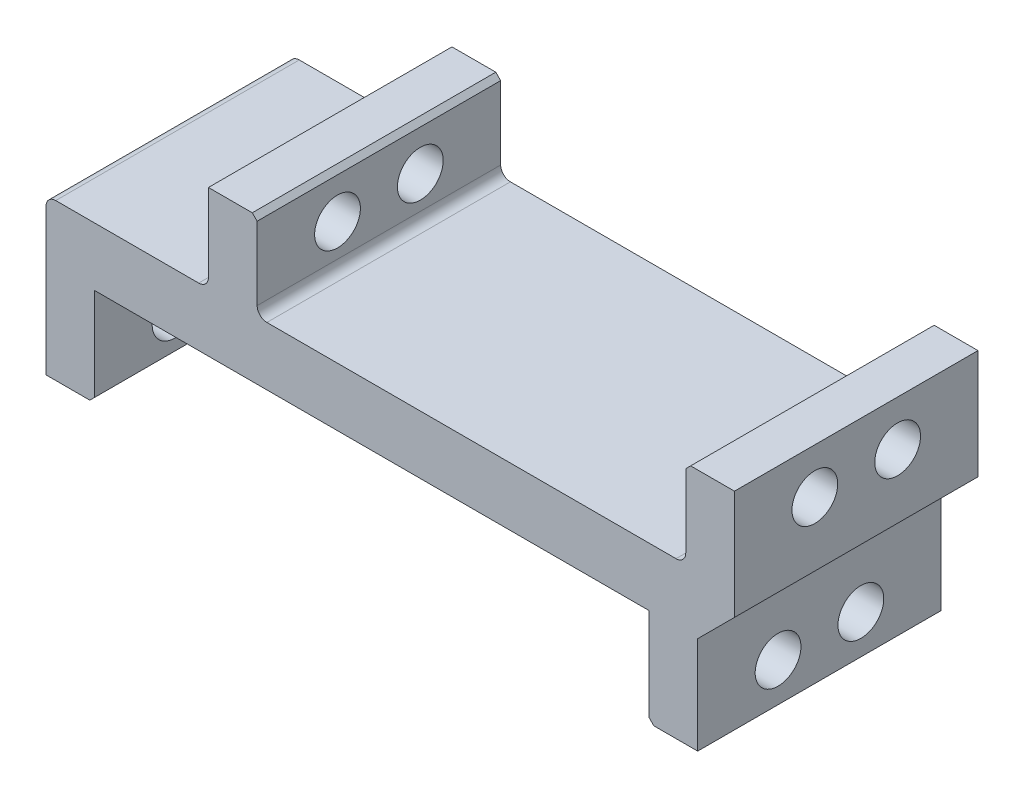
ISO-10303-21;
HEADER;
FILE_DESCRIPTION(('STEP AP214'),'2;1');
FILE_NAME('part.step','',(''),(''),'','','');
FILE_SCHEMA(('AUTOMOTIVE_DESIGN { 1 0 10303 214 1 1 1 1 }'));
ENDSEC;
DATA;
#1=APPLICATION_CONTEXT('core data for automotive mechanical design processes');
#2=APPLICATION_PROTOCOL_DEFINITION('international standard','automotive_design',2000,#1);
#3=PRODUCT_CONTEXT('',#1,'mechanical');
#4=PRODUCT('Part','Part','',(#3));
#5=PRODUCT_RELATED_PRODUCT_CATEGORY('part','',(#4));
#6=PRODUCT_DEFINITION_FORMATION('','',#4);
#7=PRODUCT_DEFINITION_CONTEXT('part definition',#1,'design');
#8=PRODUCT_DEFINITION('design','',#6,#7);
#9=PRODUCT_DEFINITION_SHAPE('','',#8);
#10=(LENGTH_UNIT() NAMED_UNIT(*) SI_UNIT(.MILLI.,.METRE.));
#11=(NAMED_UNIT(*) PLANE_ANGLE_UNIT() SI_UNIT($,.RADIAN.));
#12=(NAMED_UNIT(*) SI_UNIT($,.STERADIAN.) SOLID_ANGLE_UNIT());
#13=UNCERTAINTY_MEASURE_WITH_UNIT(LENGTH_MEASURE(1.E-05),#10,'distance_accuracy_value','');
#14=(GEOMETRIC_REPRESENTATION_CONTEXT(3) GLOBAL_UNCERTAINTY_ASSIGNED_CONTEXT((#13)) GLOBAL_UNIT_ASSIGNED_CONTEXT((#10,
#11,#12)) REPRESENTATION_CONTEXT('',''));
#15=CARTESIAN_POINT('',(0.,0.,0.));
#16=DIRECTION('',(0.,0.,1.));
#17=DIRECTION('',(1.,0.,0.));
#18=AXIS2_PLACEMENT_3D('',#15,#16,#17);
#19=CARTESIAN_POINT('',(-28.45,-9.29999999999999,12.5));
#20=DIRECTION('',(0.,1.,0.));
#21=DIRECTION('',(0.,0.,1.));
#22=AXIS2_PLACEMENT_3D('',#19,#20,#21);
#23=PLANE('',#22);
#24=DIRECTION('',(1.,0.,0.));
#25=VECTOR('',#24,1.);
#26=CARTESIAN_POINT('',(-28.45,-9.29999999999999,-12.5));
#27=LINE('',#26,#25);
#28=CARTESIAN_POINT('',(-33.45,-9.29999999999999,-12.5));
#29=VERTEX_POINT('',#28);
#30=CARTESIAN_POINT('',(-28.95,-9.29999999999999,-12.5));
#31=VERTEX_POINT('',#30);
#32=EDGE_CURVE('E267',#29,#31,#27,.T.);
#33=ORIENTED_EDGE('',*,*,#32,.T.);
#34=DIRECTION('',(0.,0.,1.));
#35=VECTOR('',#34,1.);
#36=CARTESIAN_POINT('',(-28.95,-9.29999999999999,12.5));
#37=LINE('',#36,#35);
#38=CARTESIAN_POINT('',(-28.95,-9.29999999999999,12.5));
#39=VERTEX_POINT('',#38);
#40=EDGE_CURVE('E11',#31,#39,#37,.T.);
#41=ORIENTED_EDGE('',*,*,#40,.T.);
#42=DIRECTION('',(1.,0.,0.));
#43=VECTOR('',#42,1.);
#44=CARTESIAN_POINT('',(-28.45,-9.29999999999999,12.5));
#45=LINE('',#44,#43);
#46=CARTESIAN_POINT('',(-33.45,-9.29999999999999,12.5));
#47=VERTEX_POINT('',#46);
#48=EDGE_CURVE('E214',#47,#39,#45,.T.);
#49=ORIENTED_EDGE('',*,*,#48,.F.);
#50=DIRECTION('',(0.,0.,-1.));
#51=VECTOR('',#50,1.);
#52=CARTESIAN_POINT('',(-33.45,-9.29999999999999,12.5));
#53=LINE('',#52,#51);
#54=EDGE_CURVE('E266',#47,#29,#53,.T.);
#55=ORIENTED_EDGE('',*,*,#54,.T.);
#56=EDGE_LOOP('',(#33,#41,#49,#55));
#57=FACE_BOUND('',#56,.T.);
#58=ADVANCED_FACE('F39',(#57),#23,.F.);
#59=CARTESIAN_POINT('',(-28.45,-9.29999999999999,12.5));
#60=DIRECTION('',(-1.,0.,0.));
#61=DIRECTION('',(0.,-1.,0.));
#62=AXIS2_PLACEMENT_3D('',#59,#60,#61);
#63=PLANE('',#62);
#64=CARTESIAN_POINT('',(-28.45,-5.29999999999998,4.25));
#65=DIRECTION('',(-1.,0.,0.));
#66=DIRECTION('',(0.,-1.,0.));
#67=AXIS2_PLACEMENT_3D('',#64,#65,#66);
#68=CIRCLE('',#67,2.35);
#69=CARTESIAN_POINT('',(-28.45,-7.64999999999998,4.25));
#70=VERTEX_POINT('',#69);
#71=EDGE_CURVE('E356',#70,#70,#68,.T.);
#72=ORIENTED_EDGE('',*,*,#71,.T.);
#73=EDGE_LOOP('',(#72));
#74=FACE_BOUND('',#73,.T.);
#75=CARTESIAN_POINT('',(-28.45,-5.29999999999998,-4.25));
#76=DIRECTION('',(-1.,0.,0.));
#77=DIRECTION('',(0.,-1.,0.));
#78=AXIS2_PLACEMENT_3D('',#75,#76,#77);
#79=CIRCLE('',#78,2.35);
#80=CARTESIAN_POINT('',(-28.45,-7.64999999999998,-4.25));
#81=VERTEX_POINT('',#80);
#82=EDGE_CURVE('E864',#81,#81,#79,.T.);
#83=ORIENTED_EDGE('',*,*,#82,.T.);
#84=EDGE_LOOP('',(#83));
#85=FACE_BOUND('',#84,.T.);
#86=DIRECTION('',(0.,1.,0.));
#87=VECTOR('',#86,1.);
#88=CARTESIAN_POINT('',(-28.45,-9.29999999999999,12.5));
#89=LINE('',#88,#87);
#90=CARTESIAN_POINT('',(-28.45,-8.79999999999997,12.5));
#91=VERTEX_POINT('',#90);
#92=CARTESIAN_POINT('',(-28.45,0.700000000000014,12.5));
#93=VERTEX_POINT('',#92);
#94=EDGE_CURVE('E200',#91,#93,#89,.T.);
#95=ORIENTED_EDGE('',*,*,#94,.F.);
#96=DIRECTION('',(0.,0.,-1.));
#97=VECTOR('',#96,1.);
#98=CARTESIAN_POINT('',(-28.45,-8.79999999999997,12.5));
#99=LINE('',#98,#97);
#100=CARTESIAN_POINT('',(-28.45,-8.79999999999997,-12.5));
#101=VERTEX_POINT('',#100);
#102=EDGE_CURVE('E48',#91,#101,#99,.T.);
#103=ORIENTED_EDGE('',*,*,#102,.T.);
#104=DIRECTION('',(0.,1.,0.));
#105=VECTOR('',#104,1.);
#106=CARTESIAN_POINT('',(-28.45,-9.29999999999999,-12.5));
#107=LINE('',#106,#105);
#108=CARTESIAN_POINT('',(-28.45,0.700000000000014,-12.5));
#109=VERTEX_POINT('',#108);
#110=EDGE_CURVE('E220',#101,#109,#107,.T.);
#111=ORIENTED_EDGE('',*,*,#110,.T.);
#112=DIRECTION('',(0.,0.,-1.));
#113=VECTOR('',#112,1.);
#114=CARTESIAN_POINT('',(-28.45,0.700000000000014,12.5));
#115=LINE('',#114,#113);
#116=EDGE_CURVE('E217',#93,#109,#115,.T.);
#117=ORIENTED_EDGE('',*,*,#116,.F.);
#118=EDGE_LOOP('',(#95,#103,#111,#117));
#119=FACE_BOUND('',#118,.T.);
#120=ADVANCED_FACE('F218',(#74,#85,#119),#63,.F.);
#121=CARTESIAN_POINT('',(-28.45,0.700000000000014,12.5));
#122=DIRECTION('',(0.,1.,0.));
#123=DIRECTION('',(0.,0.,1.));
#124=AXIS2_PLACEMENT_3D('',#121,#122,#123);
#125=PLANE('',#124);
#126=DIRECTION('',(1.,0.,0.));
#127=VECTOR('',#126,1.);
#128=CARTESIAN_POINT('',(-28.45,0.700000000000014,-12.5));
#129=LINE('',#128,#127);
#130=CARTESIAN_POINT('',(28.45,0.700000000000014,-12.5));
#131=VERTEX_POINT('',#130);
#132=EDGE_CURVE('E272',#109,#131,#129,.T.);
#133=ORIENTED_EDGE('',*,*,#132,.T.);
#134=DIRECTION('',(0.,0.,-1.));
#135=VECTOR('',#134,1.);
#136=CARTESIAN_POINT('',(28.45,0.700000000000014,12.5));
#137=LINE('',#136,#135);
#138=CARTESIAN_POINT('',(28.45,0.700000000000014,12.5));
#139=VERTEX_POINT('',#138);
#140=EDGE_CURVE('E224',#139,#131,#137,.T.);
#141=ORIENTED_EDGE('',*,*,#140,.F.);
#142=DIRECTION('',(1.,0.,0.));
#143=VECTOR('',#142,1.);
#144=CARTESIAN_POINT('',(-28.45,0.700000000000014,12.5));
#145=LINE('',#144,#143);
#146=EDGE_CURVE('E206',#93,#139,#145,.T.);
#147=ORIENTED_EDGE('',*,*,#146,.F.);
#148=ORIENTED_EDGE('',*,*,#116,.T.);
#149=EDGE_LOOP('',(#133,#141,#147,#148));
#150=FACE_BOUND('',#149,.T.);
#151=ADVANCED_FACE('F226',(#150),#125,.F.);
#152=CARTESIAN_POINT('',(28.45,0.700000000000014,12.5));
#153=DIRECTION('',(1.,0.,0.));
#154=DIRECTION('',(0.,1.,0.));
#155=AXIS2_PLACEMENT_3D('',#152,#153,#154);
#156=PLANE('',#155);
#157=CARTESIAN_POINT('',(28.45,-5.29999999999998,4.25));
#158=DIRECTION('',(1.,0.,0.));
#159=DIRECTION('',(0.,1.,0.));
#160=AXIS2_PLACEMENT_3D('',#157,#158,#159);
#161=CIRCLE('',#160,2.35);
#162=CARTESIAN_POINT('',(28.45,-2.94999999999998,4.25));
#163=VERTEX_POINT('',#162);
#164=EDGE_CURVE('E874',#163,#163,#161,.T.);
#165=ORIENTED_EDGE('',*,*,#164,.T.);
#166=EDGE_LOOP('',(#165));
#167=FACE_BOUND('',#166,.T.);
#168=CARTESIAN_POINT('',(28.45,-5.29999999999998,-4.25));
#169=DIRECTION('',(1.,0.,0.));
#170=DIRECTION('',(0.,1.,0.));
#171=AXIS2_PLACEMENT_3D('',#168,#169,#170);
#172=CIRCLE('',#171,2.35);
#173=CARTESIAN_POINT('',(28.45,-2.94999999999997,-4.25));
#174=VERTEX_POINT('',#173);
#175=EDGE_CURVE('E860',#174,#174,#172,.T.);
#176=ORIENTED_EDGE('',*,*,#175,.T.);
#177=EDGE_LOOP('',(#176));
#178=FACE_BOUND('',#177,.T.);
#179=DIRECTION('',(0.,-1.,0.));
#180=VECTOR('',#179,1.);
#181=CARTESIAN_POINT('',(28.45,0.700000000000014,-12.5));
#182=LINE('',#181,#180);
#183=CARTESIAN_POINT('',(28.45,-8.79999999999998,-12.5));
#184=VERTEX_POINT('',#183);
#185=EDGE_CURVE('E274',#131,#184,#182,.T.);
#186=ORIENTED_EDGE('',*,*,#185,.T.);
#187=DIRECTION('',(0.,0.,1.));
#188=VECTOR('',#187,1.);
#189=CARTESIAN_POINT('',(28.45,-8.79999999999998,12.5));
#190=LINE('',#189,#188);
#191=CARTESIAN_POINT('',(28.45,-8.79999999999998,12.5));
#192=VERTEX_POINT('',#191);
#193=EDGE_CURVE('E387',#184,#192,#190,.T.);
#194=ORIENTED_EDGE('',*,*,#193,.T.);
#195=DIRECTION('',(0.,-1.,0.));
#196=VECTOR('',#195,1.);
#197=CARTESIAN_POINT('',(28.45,0.700000000000014,12.5));
#198=LINE('',#197,#196);
#199=EDGE_CURVE('E229',#139,#192,#198,.T.);
#200=ORIENTED_EDGE('',*,*,#199,.F.);
#201=ORIENTED_EDGE('',*,*,#140,.T.);
#202=EDGE_LOOP('',(#186,#194,#200,#201));
#203=FACE_BOUND('',#202,.T.);
#204=ADVANCED_FACE('F395',(#167,#178,#203),#156,.F.);
#205=CARTESIAN_POINT('',(28.45,-9.29999999999998,12.5));
#206=DIRECTION('',(0.,1.,0.));
#207=DIRECTION('',(-1.,0.,0.));
#208=AXIS2_PLACEMENT_3D('',#205,#206,#207);
#209=PLANE('',#208);
#210=DIRECTION('',(1.,0.,0.));
#211=VECTOR('',#210,1.);
#212=CARTESIAN_POINT('',(28.45,-9.29999999999998,12.5));
#213=LINE('',#212,#211);
#214=CARTESIAN_POINT('',(28.95,-9.29999999999998,12.5));
#215=VERTEX_POINT('',#214);
#216=CARTESIAN_POINT('',(33.45,-9.29999999999998,12.5));
#217=VERTEX_POINT('',#216);
#218=EDGE_CURVE('E231',#215,#217,#213,.T.);
#219=ORIENTED_EDGE('',*,*,#218,.F.);
#220=DIRECTION('',(0.,0.,-1.));
#221=VECTOR('',#220,1.);
#222=CARTESIAN_POINT('',(28.95,-9.29999999999998,12.5));
#223=LINE('',#222,#221);
#224=CARTESIAN_POINT('',(28.95,-9.29999999999998,-12.5));
#225=VERTEX_POINT('',#224);
#226=EDGE_CURVE('E384',#215,#225,#223,.T.);
#227=ORIENTED_EDGE('',*,*,#226,.T.);
#228=DIRECTION('',(1.,0.,0.));
#229=VECTOR('',#228,1.);
#230=CARTESIAN_POINT('',(28.45,-9.29999999999998,-12.5));
#231=LINE('',#230,#229);
#232=CARTESIAN_POINT('',(33.45,-9.29999999999998,-12.5));
#233=VERTEX_POINT('',#232);
#234=EDGE_CURVE('E277',#225,#233,#231,.T.);
#235=ORIENTED_EDGE('',*,*,#234,.T.);
#236=DIRECTION('',(0.,0.,-1.));
#237=VECTOR('',#236,1.);
#238=CARTESIAN_POINT('',(33.45,-9.29999999999998,12.5));
#239=LINE('',#238,#237);
#240=EDGE_CURVE('E348',#217,#233,#239,.T.);
#241=ORIENTED_EDGE('',*,*,#240,.F.);
#242=EDGE_LOOP('',(#219,#227,#235,#241));
#243=FACE_BOUND('',#242,.T.);
#244=ADVANCED_FACE('F404',(#243),#209,.F.);
#245=CARTESIAN_POINT('',(33.45,-9.29999999999998,12.5));
#246=DIRECTION('',(-1.,0.,0.));
#247=DIRECTION('',(0.,-1.,0.));
#248=AXIS2_PLACEMENT_3D('',#245,#246,#247);
#249=PLANE('',#248);
#250=CARTESIAN_POINT('',(33.45,-5.29999999999998,4.25));
#251=DIRECTION('',(-1.,0.,0.));
#252=DIRECTION('',(0.,-1.,0.));
#253=AXIS2_PLACEMENT_3D('',#250,#251,#252);
#254=CIRCLE('',#253,2.35);
#255=CARTESIAN_POINT('',(33.45,-7.64999999999998,4.25));
#256=VERTEX_POINT('',#255);
#257=EDGE_CURVE('E856',#256,#256,#254,.T.);
#258=ORIENTED_EDGE('',*,*,#257,.T.);
#259=EDGE_LOOP('',(#258));
#260=FACE_BOUND('',#259,.T.);
#261=CARTESIAN_POINT('',(33.45,-5.29999999999998,-4.25));
#262=DIRECTION('',(-1.,0.,0.));
#263=DIRECTION('',(0.,-1.,0.));
#264=AXIS2_PLACEMENT_3D('',#261,#262,#263);
#265=CIRCLE('',#264,2.35);
#266=CARTESIAN_POINT('',(33.45,-7.64999999999998,-4.25));
#267=VERTEX_POINT('',#266);
#268=EDGE_CURVE('E859',#267,#267,#265,.T.);
#269=ORIENTED_EDGE('',*,*,#268,.T.);
#270=EDGE_LOOP('',(#269));
#271=FACE_BOUND('',#270,.T.);
#272=DIRECTION('',(0.,1.,0.));
#273=VECTOR('',#272,1.);
#274=CARTESIAN_POINT('',(33.45,-9.29999999999998,-12.5));
#275=LINE('',#274,#273);
#276=CARTESIAN_POINT('',(33.45,0.700000000000022,-12.5));
#277=VERTEX_POINT('',#276);
#278=EDGE_CURVE('E279',#233,#277,#275,.T.);
#279=ORIENTED_EDGE('',*,*,#278,.T.);
#280=DIRECTION('',(0.,0.,-1.));
#281=VECTOR('',#280,1.);
#282=CARTESIAN_POINT('',(33.45,0.700000000000022,12.5));
#283=LINE('',#282,#281);
#284=CARTESIAN_POINT('',(33.45,0.700000000000022,12.5));
#285=VERTEX_POINT('',#284);
#286=EDGE_CURVE('E345',#285,#277,#283,.T.);
#287=ORIENTED_EDGE('',*,*,#286,.F.);
#288=DIRECTION('',(0.,1.,0.));
#289=VECTOR('',#288,1.);
#290=CARTESIAN_POINT('',(33.45,-9.29999999999998,12.5));
#291=LINE('',#290,#289);
#292=EDGE_CURVE('E236',#217,#285,#291,.T.);
#293=ORIENTED_EDGE('',*,*,#292,.F.);
#294=ORIENTED_EDGE('',*,*,#240,.T.);
#295=EDGE_LOOP('',(#279,#287,#293,#294));
#296=FACE_BOUND('',#295,.T.);
#297=ADVANCED_FACE('F411',(#260,#271,#296),#249,.F.);
#298=CARTESIAN_POINT('',(33.45,0.700000000000022,12.5));
#299=DIRECTION('',(-0.707106781186546,0.707106781186549,0.));
#300=DIRECTION('',(-0.707106781186549,-0.707106781186546,0.));
#301=AXIS2_PLACEMENT_3D('',#298,#299,#300);
#302=PLANE('',#301);
#303=DIRECTION('',(0.707106781186549,0.707106781186546,0.));
#304=VECTOR('',#303,1.);
#305=CARTESIAN_POINT('',(33.45,0.700000000000022,-12.5));
#306=LINE('',#305,#304);
#307=CARTESIAN_POINT('',(37.225,4.47499999999999,-12.5));
#308=VERTEX_POINT('',#307);
#309=EDGE_CURVE('E281',#277,#308,#306,.T.);
#310=ORIENTED_EDGE('',*,*,#309,.T.);
#311=DIRECTION('',(0.,0.,-1.));
#312=VECTOR('',#311,1.);
#313=CARTESIAN_POINT('',(37.225,4.47499999999999,12.5));
#314=LINE('',#313,#312);
#315=CARTESIAN_POINT('',(37.225,4.47499999999999,12.5));
#316=VERTEX_POINT('',#315);
#317=EDGE_CURVE('E342',#316,#308,#314,.T.);
#318=ORIENTED_EDGE('',*,*,#317,.F.);
#319=DIRECTION('',(0.707106781186549,0.707106781186546,0.));
#320=VECTOR('',#319,1.);
#321=CARTESIAN_POINT('',(33.45,0.700000000000022,12.5));
#322=LINE('',#321,#320);
#323=EDGE_CURVE('E238',#285,#316,#322,.T.);
#324=ORIENTED_EDGE('',*,*,#323,.F.);
#325=ORIENTED_EDGE('',*,*,#286,.T.);
#326=EDGE_LOOP('',(#310,#318,#324,#325));
#327=FACE_BOUND('',#326,.T.);
#328=ADVANCED_FACE('F415',(#327),#302,.F.);
#329=CARTESIAN_POINT('',(37.225,4.47499999999999,12.5));
#330=DIRECTION('',(-1.,0.,0.));
#331=DIRECTION('',(0.,0.,1.));
#332=AXIS2_PLACEMENT_3D('',#329,#330,#331);
#333=PLANE('',#332);
#334=CARTESIAN_POINT('',(37.225,11.05,-4.25));
#335=DIRECTION('',(1.,0.,0.));
#336=DIRECTION('',(0.,0.,-1.));
#337=AXIS2_PLACEMENT_3D('',#334,#335,#336);
#338=CIRCLE('',#337,2.35);
#339=CARTESIAN_POINT('',(37.225,11.05,-6.6));
#340=VERTEX_POINT('',#339);
#341=EDGE_CURVE('E867',#340,#340,#338,.T.);
#342=ORIENTED_EDGE('',*,*,#341,.F.);
#343=EDGE_LOOP('',(#342));
#344=FACE_BOUND('',#343,.T.);
#345=CARTESIAN_POINT('',(37.225,11.05,4.25));
#346=DIRECTION('',(1.,0.,0.));
#347=DIRECTION('',(0.,0.,-1.));
#348=AXIS2_PLACEMENT_3D('',#345,#346,#347);
#349=CIRCLE('',#348,2.35);
#350=CARTESIAN_POINT('',(37.225,11.05,1.9));
#351=VERTEX_POINT('',#350);
#352=EDGE_CURVE('E861',#351,#351,#349,.T.);
#353=ORIENTED_EDGE('',*,*,#352,.F.);
#354=EDGE_LOOP('',(#353));
#355=FACE_BOUND('',#354,.T.);
#356=DIRECTION('',(0.,1.,0.));
#357=VECTOR('',#356,1.);
#358=CARTESIAN_POINT('',(37.225,4.47499999999999,-12.5));
#359=LINE('',#358,#357);
#360=CARTESIAN_POINT('',(37.225,15.7,-12.5));
#361=VERTEX_POINT('',#360);
#362=EDGE_CURVE('E283',#308,#361,#359,.T.);
#363=ORIENTED_EDGE('',*,*,#362,.T.);
#364=DIRECTION('',(0.,0.,-1.));
#365=VECTOR('',#364,1.);
#366=CARTESIAN_POINT('',(37.225,15.7,12.5));
#367=LINE('',#366,#365);
#368=CARTESIAN_POINT('',(37.225,15.7,12.5));
#369=VERTEX_POINT('',#368);
#370=EDGE_CURVE('E339',#369,#361,#367,.T.);
#371=ORIENTED_EDGE('',*,*,#370,.F.);
#372=DIRECTION('',(0.,1.,0.));
#373=VECTOR('',#372,1.);
#374=CARTESIAN_POINT('',(37.225,4.47499999999999,12.5));
#375=LINE('',#374,#373);
#376=EDGE_CURVE('E240',#316,#369,#375,.T.);
#377=ORIENTED_EDGE('',*,*,#376,.F.);
#378=ORIENTED_EDGE('',*,*,#317,.T.);
#379=EDGE_LOOP('',(#363,#371,#377,#378));
#380=FACE_BOUND('',#379,.T.);
#381=ADVANCED_FACE('F422',(#344,#355,#380),#333,.F.);
#382=CARTESIAN_POINT('',(37.225,15.7,12.5));
#383=DIRECTION('',(0.,-1.,0.));
#384=DIRECTION('',(0.,0.,-1.));
#385=AXIS2_PLACEMENT_3D('',#382,#383,#384);
#386=PLANE('',#385);
#387=DIRECTION('',(-1.,0.,0.));
#388=VECTOR('',#387,1.);
#389=CARTESIAN_POINT('',(37.225,15.7,-12.5));
#390=LINE('',#389,#388);
#391=CARTESIAN_POINT('',(32.725,15.7,-12.5));
#392=VERTEX_POINT('',#391);
#393=EDGE_CURVE('E285',#361,#392,#390,.T.);
#394=ORIENTED_EDGE('',*,*,#393,.T.);
#395=DIRECTION('',(0.,0.,1.));
#396=VECTOR('',#395,1.);
#397=CARTESIAN_POINT('',(32.725,15.7,12.5));
#398=LINE('',#397,#396);
#399=CARTESIAN_POINT('',(32.725,15.7,12.5));
#400=VERTEX_POINT('',#399);
#401=EDGE_CURVE('E372',#392,#400,#398,.T.);
#402=ORIENTED_EDGE('',*,*,#401,.T.);
#403=DIRECTION('',(-1.,0.,0.));
#404=VECTOR('',#403,1.);
#405=CARTESIAN_POINT('',(37.225,15.7,12.5));
#406=LINE('',#405,#404);
#407=EDGE_CURVE('E242',#369,#400,#406,.T.);
#408=ORIENTED_EDGE('',*,*,#407,.F.);
#409=ORIENTED_EDGE('',*,*,#370,.T.);
#410=EDGE_LOOP('',(#394,#402,#408,#409));
#411=FACE_BOUND('',#410,.T.);
#412=ADVANCED_FACE('F425',(#411),#386,.F.);
#413=CARTESIAN_POINT('',(32.225,15.7,12.5));
#414=DIRECTION('',(1.,0.,0.));
#415=DIRECTION('',(0.,0.,-1.));
#416=AXIS2_PLACEMENT_3D('',#413,#414,#415);
#417=PLANE('',#416);
#418=CARTESIAN_POINT('',(32.225,11.05,-4.25));
#419=DIRECTION('',(1.,0.,0.));
#420=DIRECTION('',(0.,0.,-1.));
#421=AXIS2_PLACEMENT_3D('',#418,#419,#420);
#422=CIRCLE('',#421,2.35);
#423=CARTESIAN_POINT('',(32.225,11.05,-6.6));
#424=VERTEX_POINT('',#423);
#425=EDGE_CURVE('E270',#424,#424,#422,.T.);
#426=ORIENTED_EDGE('',*,*,#425,.T.);
#427=EDGE_LOOP('',(#426));
#428=FACE_BOUND('',#427,.T.);
#429=CARTESIAN_POINT('',(32.225,11.05,4.25));
#430=DIRECTION('',(1.,0.,0.));
#431=DIRECTION('',(0.,0.,-1.));
#432=AXIS2_PLACEMENT_3D('',#429,#430,#431);
#433=CIRCLE('',#432,2.35);
#434=CARTESIAN_POINT('',(32.225,11.05,1.9));
#435=VERTEX_POINT('',#434);
#436=EDGE_CURVE('E361',#435,#435,#433,.T.);
#437=ORIENTED_EDGE('',*,*,#436,.T.);
#438=EDGE_LOOP('',(#437));
#439=FACE_BOUND('',#438,.T.);
#440=DIRECTION('',(0.,-1.,0.));
#441=VECTOR('',#440,1.);
#442=CARTESIAN_POINT('',(32.225,15.7,12.5));
#443=LINE('',#442,#441);
#444=CARTESIAN_POINT('',(32.225,15.2,12.5));
#445=VERTEX_POINT('',#444);
#446=CARTESIAN_POINT('',(32.225,7.70000000000001,12.5));
#447=VERTEX_POINT('',#446);
#448=EDGE_CURVE('E244',#445,#447,#443,.T.);
#449=ORIENTED_EDGE('',*,*,#448,.F.);
#450=DIRECTION('',(0.,0.,-1.));
#451=VECTOR('',#450,1.);
#452=CARTESIAN_POINT('',(32.225,15.2,12.5));
#453=LINE('',#452,#451);
#454=CARTESIAN_POINT('',(32.225,15.2,-12.5));
#455=VERTEX_POINT('',#454);
#456=EDGE_CURVE('E223',#445,#455,#453,.T.);
#457=ORIENTED_EDGE('',*,*,#456,.T.);
#458=DIRECTION('',(0.,-1.,0.));
#459=VECTOR('',#458,1.);
#460=CARTESIAN_POINT('',(32.225,15.7,-12.5));
#461=LINE('',#460,#459);
#462=CARTESIAN_POINT('',(32.225,7.70000000000001,-12.5));
#463=VERTEX_POINT('',#462);
#464=EDGE_CURVE('E288',#455,#463,#461,.T.);
#465=ORIENTED_EDGE('',*,*,#464,.T.);
#466=DIRECTION('',(0.,0.,-1.));
#467=VECTOR('',#466,1.);
#468=CARTESIAN_POINT('',(32.225,7.70000000000001,12.5));
#469=LINE('',#468,#467);
#470=EDGE_CURVE('E336',#447,#463,#469,.T.);
#471=ORIENTED_EDGE('',*,*,#470,.F.);
#472=EDGE_LOOP('',(#449,#457,#465,#471));
#473=FACE_BOUND('',#472,.T.);
#474=ADVANCED_FACE('F433',(#428,#439,#473),#417,.F.);
#475=CARTESIAN_POINT('',(31.225,7.70000000000001,12.5));
#476=DIRECTION('',(0.,0.,-1.));
#477=DIRECTION('',(-1.,0.,0.));
#478=AXIS2_PLACEMENT_3D('',#475,#476,#477);
#479=CYLINDRICAL_SURFACE('',#478,1.);
#480=CARTESIAN_POINT('',(31.225,7.70000000000001,-12.5));
#481=DIRECTION('',(0.,0.,-1.));
#482=DIRECTION('',(-1.,0.,0.));
#483=AXIS2_PLACEMENT_3D('',#480,#481,#482);
#484=CIRCLE('',#483,1.);
#485=CARTESIAN_POINT('',(31.225,6.70000000000001,-12.5));
#486=VERTEX_POINT('',#485);
#487=EDGE_CURVE('E290',#463,#486,#484,.T.);
#488=ORIENTED_EDGE('',*,*,#487,.T.);
#489=DIRECTION('',(0.,0.,-1.));
#490=VECTOR('',#489,1.);
#491=CARTESIAN_POINT('',(31.225,6.70000000000001,12.5));
#492=LINE('',#491,#490);
#493=CARTESIAN_POINT('',(31.225,6.70000000000001,12.5));
#494=VERTEX_POINT('',#493);
#495=EDGE_CURVE('E333',#494,#486,#492,.T.);
#496=ORIENTED_EDGE('',*,*,#495,.F.);
#497=CARTESIAN_POINT('',(31.225,7.70000000000001,12.5));
#498=DIRECTION('',(0.,0.,-1.));
#499=DIRECTION('',(-1.,0.,0.));
#500=AXIS2_PLACEMENT_3D('',#497,#498,#499);
#501=CIRCLE('',#500,1.);
#502=EDGE_CURVE('E246',#447,#494,#501,.T.);
#503=ORIENTED_EDGE('',*,*,#502,.F.);
#504=ORIENTED_EDGE('',*,*,#470,.T.);
#505=EDGE_LOOP('',(#488,#496,#503,#504));
#506=FACE_BOUND('',#505,.T.);
#507=ADVANCED_FACE('F438',(#506),#479,.F.);
#508=CARTESIAN_POINT('',(-10.775,6.70000000000001,12.5));
#509=DIRECTION('',(0.,-1.,0.));
#510=DIRECTION('',(0.,0.,-1.));
#511=AXIS2_PLACEMENT_3D('',#508,#509,#510);
#512=PLANE('',#511);
#513=DIRECTION('',(-1.,0.,0.));
#514=VECTOR('',#513,1.);
#515=CARTESIAN_POINT('',(-10.775,6.70000000000001,-12.5));
#516=LINE('',#515,#514);
#517=CARTESIAN_POINT('',(-10.775,6.70000000000001,-12.5));
#518=VERTEX_POINT('',#517);
#519=EDGE_CURVE('E292',#486,#518,#516,.T.);
#520=ORIENTED_EDGE('',*,*,#519,.T.);
#521=DIRECTION('',(0.,0.,-1.));
#522=VECTOR('',#521,1.);
#523=CARTESIAN_POINT('',(-10.775,6.70000000000001,12.5));
#524=LINE('',#523,#522);
#525=CARTESIAN_POINT('',(-10.775,6.70000000000001,12.5));
#526=VERTEX_POINT('',#525);
#527=EDGE_CURVE('E330',#526,#518,#524,.T.);
#528=ORIENTED_EDGE('',*,*,#527,.F.);
#529=DIRECTION('',(-1.,0.,0.));
#530=VECTOR('',#529,1.);
#531=CARTESIAN_POINT('',(-10.775,6.70000000000001,12.5));
#532=LINE('',#531,#530);
#533=EDGE_CURVE('E248',#494,#526,#532,.T.);
#534=ORIENTED_EDGE('',*,*,#533,.F.);
#535=ORIENTED_EDGE('',*,*,#495,.T.);
#536=EDGE_LOOP('',(#520,#528,#534,#535));
#537=FACE_BOUND('',#536,.T.);
#538=ADVANCED_FACE('F444',(#537),#512,.F.);
#539=CARTESIAN_POINT('',(-10.775,7.70000000000001,12.5));
#540=DIRECTION('',(0.,0.,-1.));
#541=DIRECTION('',(-1.,0.,0.));
#542=AXIS2_PLACEMENT_3D('',#539,#540,#541);
#543=CYLINDRICAL_SURFACE('',#542,1.);
#544=CARTESIAN_POINT('',(-10.775,7.70000000000001,-12.5));
#545=DIRECTION('',(0.,0.,-1.));
#546=DIRECTION('',(1.,0.,0.));
#547=AXIS2_PLACEMENT_3D('',#544,#545,#546);
#548=CIRCLE('',#547,1.);
#549=CARTESIAN_POINT('',(-11.775,7.70000000000001,-12.5));
#550=VERTEX_POINT('',#549);
#551=EDGE_CURVE('E294',#518,#550,#548,.T.);
#552=ORIENTED_EDGE('',*,*,#551,.T.);
#553=DIRECTION('',(0.,0.,-1.));
#554=VECTOR('',#553,1.);
#555=CARTESIAN_POINT('',(-11.775,7.70000000000001,12.5));
#556=LINE('',#555,#554);
#557=CARTESIAN_POINT('',(-11.775,7.70000000000001,12.5));
#558=VERTEX_POINT('',#557);
#559=EDGE_CURVE('E327',#558,#550,#556,.T.);
#560=ORIENTED_EDGE('',*,*,#559,.F.);
#561=CARTESIAN_POINT('',(-10.775,7.70000000000001,12.5));
#562=DIRECTION('',(0.,0.,-1.));
#563=DIRECTION('',(1.,0.,0.));
#564=AXIS2_PLACEMENT_3D('',#561,#562,#563);
#565=CIRCLE('',#564,1.);
#566=EDGE_CURVE('E250',#526,#558,#565,.T.);
#567=ORIENTED_EDGE('',*,*,#566,.F.);
#568=ORIENTED_EDGE('',*,*,#527,.T.);
#569=EDGE_LOOP('',(#552,#560,#567,#568));
#570=FACE_BOUND('',#569,.T.);
#571=ADVANCED_FACE('F448',(#570),#543,.F.);
#572=CARTESIAN_POINT('',(-11.775,15.7,12.5));
#573=DIRECTION('',(-1.,0.,0.));
#574=DIRECTION('',(0.,0.,1.));
#575=AXIS2_PLACEMENT_3D('',#572,#573,#574);
#576=PLANE('',#575);
#577=CARTESIAN_POINT('',(-11.775,11.05,-4.25));
#578=DIRECTION('',(-1.,0.,0.));
#579=DIRECTION('',(0.,0.,1.));
#580=AXIS2_PLACEMENT_3D('',#577,#578,#579);
#581=CIRCLE('',#580,2.35);
#582=CARTESIAN_POINT('',(-11.775,11.05,-1.9));
#583=VERTEX_POINT('',#582);
#584=EDGE_CURVE('E360',#583,#583,#581,.T.);
#585=ORIENTED_EDGE('',*,*,#584,.T.);
#586=EDGE_LOOP('',(#585));
#587=FACE_BOUND('',#586,.T.);
#588=CARTESIAN_POINT('',(-11.775,11.05,4.25));
#589=DIRECTION('',(-1.,0.,0.));
#590=DIRECTION('',(0.,0.,1.));
#591=AXIS2_PLACEMENT_3D('',#588,#589,#590);
#592=CIRCLE('',#591,2.35);
#593=CARTESIAN_POINT('',(-11.775,11.05,6.6));
#594=VERTEX_POINT('',#593);
#595=EDGE_CURVE('E355',#594,#594,#592,.T.);
#596=ORIENTED_EDGE('',*,*,#595,.T.);
#597=EDGE_LOOP('',(#596));
#598=FACE_BOUND('',#597,.T.);
#599=DIRECTION('',(0.,1.,0.));
#600=VECTOR('',#599,1.);
#601=CARTESIAN_POINT('',(-11.775,15.7,-12.5));
#602=LINE('',#601,#600);
#603=CARTESIAN_POINT('',(-11.775,15.2,-12.5));
#604=VERTEX_POINT('',#603);
#605=EDGE_CURVE('E296',#550,#604,#602,.T.);
#606=ORIENTED_EDGE('',*,*,#605,.T.);
#607=DIRECTION('',(0.,0.,1.));
#608=VECTOR('',#607,1.);
#609=CARTESIAN_POINT('',(-11.775,15.2,12.5));
#610=LINE('',#609,#608);
#611=CARTESIAN_POINT('',(-11.775,15.2,12.5));
#612=VERTEX_POINT('',#611);
#613=EDGE_CURVE('E63',#604,#612,#610,.T.);
#614=ORIENTED_EDGE('',*,*,#613,.T.);
#615=DIRECTION('',(0.,1.,0.));
#616=VECTOR('',#615,1.);
#617=CARTESIAN_POINT('',(-11.775,15.7,12.5));
#618=LINE('',#617,#616);
#619=EDGE_CURVE('E252',#558,#612,#618,.T.);
#620=ORIENTED_EDGE('',*,*,#619,.F.);
#621=ORIENTED_EDGE('',*,*,#559,.T.);
#622=EDGE_LOOP('',(#606,#614,#620,#621));
#623=FACE_BOUND('',#622,.T.);
#624=ADVANCED_FACE('F450',(#587,#598,#623),#576,.F.);
#625=CARTESIAN_POINT('',(-16.775,15.7,12.5));
#626=DIRECTION('',(0.,-1.,0.));
#627=DIRECTION('',(0.,0.,-1.));
#628=AXIS2_PLACEMENT_3D('',#625,#626,#627);
#629=PLANE('',#628);
#630=DIRECTION('',(-1.,0.,0.));
#631=VECTOR('',#630,1.);
#632=CARTESIAN_POINT('',(-16.775,15.7,12.5));
#633=LINE('',#632,#631);
#634=CARTESIAN_POINT('',(-12.275,15.7,12.5));
#635=VERTEX_POINT('',#634);
#636=CARTESIAN_POINT('',(-16.775,15.7,12.5));
#637=VERTEX_POINT('',#636);
#638=EDGE_CURVE('E254',#635,#637,#633,.T.);
#639=ORIENTED_EDGE('',*,*,#638,.F.);
#640=DIRECTION('',(0.,0.,-1.));
#641=VECTOR('',#640,1.);
#642=CARTESIAN_POINT('',(-12.275,15.7,12.5));
#643=LINE('',#642,#641);
#644=CARTESIAN_POINT('',(-12.275,15.7,-12.5));
#645=VERTEX_POINT('',#644);
#646=EDGE_CURVE('E380',#635,#645,#643,.T.);
#647=ORIENTED_EDGE('',*,*,#646,.T.);
#648=DIRECTION('',(-1.,0.,0.));
#649=VECTOR('',#648,1.);
#650=CARTESIAN_POINT('',(-16.775,15.7,-12.5));
#651=LINE('',#650,#649);
#652=CARTESIAN_POINT('',(-16.775,15.7,-12.5));
#653=VERTEX_POINT('',#652);
#654=EDGE_CURVE('E298',#645,#653,#651,.T.);
#655=ORIENTED_EDGE('',*,*,#654,.T.);
#656=DIRECTION('',(0.,0.,-1.));
#657=VECTOR('',#656,1.);
#658=CARTESIAN_POINT('',(-16.775,15.7,12.5));
#659=LINE('',#658,#657);
#660=EDGE_CURVE('E324',#637,#653,#659,.T.);
#661=ORIENTED_EDGE('',*,*,#660,.F.);
#662=EDGE_LOOP('',(#639,#647,#655,#661));
#663=FACE_BOUND('',#662,.T.);
#664=ADVANCED_FACE('F456',(#663),#629,.F.);
#665=CARTESIAN_POINT('',(-16.775,7.70000000000001,12.5));
#666=DIRECTION('',(1.,0.,0.));
#667=DIRECTION('',(0.,0.,-1.));
#668=AXIS2_PLACEMENT_3D('',#665,#666,#667);
#669=PLANE('',#668);
#670=CARTESIAN_POINT('',(-16.775,11.05,-4.25));
#671=DIRECTION('',(1.,0.,0.));
#672=DIRECTION('',(0.,0.,-1.));
#673=AXIS2_PLACEMENT_3D('',#670,#671,#672);
#674=CIRCLE('',#673,2.35);
#675=CARTESIAN_POINT('',(-16.775,11.05,-6.6));
#676=VERTEX_POINT('',#675);
#677=EDGE_CURVE('E357',#676,#676,#674,.T.);
#678=ORIENTED_EDGE('',*,*,#677,.T.);
#679=EDGE_LOOP('',(#678));
#680=FACE_BOUND('',#679,.T.);
#681=CARTESIAN_POINT('',(-16.775,11.05,4.25));
#682=DIRECTION('',(1.,0.,0.));
#683=DIRECTION('',(0.,0.,-1.));
#684=AXIS2_PLACEMENT_3D('',#681,#682,#683);
#685=CIRCLE('',#684,2.35);
#686=CARTESIAN_POINT('',(-16.775,11.05,1.9));
#687=VERTEX_POINT('',#686);
#688=EDGE_CURVE('E352',#687,#687,#685,.T.);
#689=ORIENTED_EDGE('',*,*,#688,.T.);
#690=EDGE_LOOP('',(#689));
#691=FACE_BOUND('',#690,.T.);
#692=DIRECTION('',(0.,-1.,0.));
#693=VECTOR('',#692,1.);
#694=CARTESIAN_POINT('',(-16.775,7.70000000000001,-12.5));
#695=LINE('',#694,#693);
#696=CARTESIAN_POINT('',(-16.775,7.70000000000001,-12.5));
#697=VERTEX_POINT('',#696);
#698=EDGE_CURVE('E300',#653,#697,#695,.T.);
#699=ORIENTED_EDGE('',*,*,#698,.T.);
#700=DIRECTION('',(0.,0.,-1.));
#701=VECTOR('',#700,1.);
#702=CARTESIAN_POINT('',(-16.775,7.70000000000001,12.5));
#703=LINE('',#702,#701);
#704=CARTESIAN_POINT('',(-16.775,7.70000000000001,12.5));
#705=VERTEX_POINT('',#704);
#706=EDGE_CURVE('E321',#705,#697,#703,.T.);
#707=ORIENTED_EDGE('',*,*,#706,.F.);
#708=DIRECTION('',(0.,-1.,0.));
#709=VECTOR('',#708,1.);
#710=CARTESIAN_POINT('',(-16.775,7.70000000000001,12.5));
#711=LINE('',#710,#709);
#712=EDGE_CURVE('E256',#637,#705,#711,.T.);
#713=ORIENTED_EDGE('',*,*,#712,.F.);
#714=ORIENTED_EDGE('',*,*,#660,.T.);
#715=EDGE_LOOP('',(#699,#707,#713,#714));
#716=FACE_BOUND('',#715,.T.);
#717=ADVANCED_FACE('F463',(#680,#691,#716),#669,.F.);
#718=CARTESIAN_POINT('',(-17.775,7.70000000000001,12.5));
#719=DIRECTION('',(0.,0.,-1.));
#720=DIRECTION('',(-1.,0.,0.));
#721=AXIS2_PLACEMENT_3D('',#718,#719,#720);
#722=CYLINDRICAL_SURFACE('',#721,1.);
#723=CARTESIAN_POINT('',(-17.775,7.70000000000001,-12.5));
#724=DIRECTION('',(0.,0.,-1.));
#725=DIRECTION('',(1.,0.,0.));
#726=AXIS2_PLACEMENT_3D('',#723,#724,#725);
#727=CIRCLE('',#726,1.);
#728=CARTESIAN_POINT('',(-17.775,6.70000000000001,-12.5));
#729=VERTEX_POINT('',#728);
#730=EDGE_CURVE('E302',#697,#729,#727,.T.);
#731=ORIENTED_EDGE('',*,*,#730,.T.);
#732=DIRECTION('',(0.,0.,-1.));
#733=VECTOR('',#732,1.);
#734=CARTESIAN_POINT('',(-17.775,6.70000000000001,12.5));
#735=LINE('',#734,#733);
#736=CARTESIAN_POINT('',(-17.775,6.70000000000001,12.5));
#737=VERTEX_POINT('',#736);
#738=EDGE_CURVE('E318',#737,#729,#735,.T.);
#739=ORIENTED_EDGE('',*,*,#738,.F.);
#740=CARTESIAN_POINT('',(-17.775,7.70000000000001,12.5));
#741=DIRECTION('',(0.,0.,-1.));
#742=DIRECTION('',(1.,0.,0.));
#743=AXIS2_PLACEMENT_3D('',#740,#741,#742);
#744=CIRCLE('',#743,1.);
#745=EDGE_CURVE('E258',#705,#737,#744,.T.);
#746=ORIENTED_EDGE('',*,*,#745,.F.);
#747=ORIENTED_EDGE('',*,*,#706,.T.);
#748=EDGE_LOOP('',(#731,#739,#746,#747));
#749=FACE_BOUND('',#748,.T.);
#750=ADVANCED_FACE('F467',(#749),#722,.F.);
#751=CARTESIAN_POINT('',(-32.45,6.70000000000001,12.5));
#752=DIRECTION('',(0.,-1.,0.));
#753=DIRECTION('',(1.,0.,0.));
#754=AXIS2_PLACEMENT_3D('',#751,#752,#753);
#755=PLANE('',#754);
#756=DIRECTION('',(-1.,0.,0.));
#757=VECTOR('',#756,1.);
#758=CARTESIAN_POINT('',(-32.45,6.70000000000001,-12.5));
#759=LINE('',#758,#757);
#760=CARTESIAN_POINT('',(-32.45,6.70000000000001,-12.5));
#761=VERTEX_POINT('',#760);
#762=EDGE_CURVE('E304',#729,#761,#759,.T.);
#763=ORIENTED_EDGE('',*,*,#762,.T.);
#764=DIRECTION('',(0.,0.,-1.));
#765=VECTOR('',#764,1.);
#766=CARTESIAN_POINT('',(-32.45,6.70000000000001,12.5));
#767=LINE('',#766,#765);
#768=CARTESIAN_POINT('',(-32.45,6.70000000000001,12.5));
#769=VERTEX_POINT('',#768);
#770=EDGE_CURVE('E315',#769,#761,#767,.T.);
#771=ORIENTED_EDGE('',*,*,#770,.F.);
#772=DIRECTION('',(-1.,0.,0.));
#773=VECTOR('',#772,1.);
#774=CARTESIAN_POINT('',(-32.45,6.70000000000001,12.5));
#775=LINE('',#774,#773);
#776=EDGE_CURVE('E260',#737,#769,#775,.T.);
#777=ORIENTED_EDGE('',*,*,#776,.F.);
#778=ORIENTED_EDGE('',*,*,#738,.T.);
#779=EDGE_LOOP('',(#763,#771,#777,#778));
#780=FACE_BOUND('',#779,.T.);
#781=ADVANCED_FACE('F474',(#780),#755,.F.);
#782=CARTESIAN_POINT('',(-32.45,5.70000000000001,12.5));
#783=DIRECTION('',(0.,0.,-1.));
#784=DIRECTION('',(-1.,0.,0.));
#785=AXIS2_PLACEMENT_3D('',#782,#783,#784);
#786=CYLINDRICAL_SURFACE('',#785,0.999999999999997);
#787=CARTESIAN_POINT('',(-32.45,5.70000000000001,-12.5));
#788=DIRECTION('',(0.,0.,1.));
#789=DIRECTION('',(-1.,0.,0.));
#790=AXIS2_PLACEMENT_3D('',#787,#788,#789);
#791=CIRCLE('',#790,0.999999999999997);
#792=CARTESIAN_POINT('',(-33.45,5.70000000000001,-12.5));
#793=VERTEX_POINT('',#792);
#794=EDGE_CURVE('E306',#761,#793,#791,.T.);
#795=ORIENTED_EDGE('',*,*,#794,.T.);
#796=DIRECTION('',(0.,0.,-1.));
#797=VECTOR('',#796,1.);
#798=CARTESIAN_POINT('',(-33.45,5.70000000000001,12.5));
#799=LINE('',#798,#797);
#800=CARTESIAN_POINT('',(-33.45,5.70000000000001,12.5));
#801=VERTEX_POINT('',#800);
#802=EDGE_CURVE('E312',#801,#793,#799,.T.);
#803=ORIENTED_EDGE('',*,*,#802,.F.);
#804=CARTESIAN_POINT('',(-32.45,5.70000000000001,12.5));
#805=DIRECTION('',(0.,0.,1.));
#806=DIRECTION('',(-1.,0.,0.));
#807=AXIS2_PLACEMENT_3D('',#804,#805,#806);
#808=CIRCLE('',#807,0.999999999999997);
#809=EDGE_CURVE('E262',#769,#801,#808,.T.);
#810=ORIENTED_EDGE('',*,*,#809,.F.);
#811=ORIENTED_EDGE('',*,*,#770,.T.);
#812=EDGE_LOOP('',(#795,#803,#810,#811));
#813=FACE_BOUND('',#812,.T.);
#814=ADVANCED_FACE('F477',(#813),#786,.T.);
#815=CARTESIAN_POINT('',(-33.45,-9.29999999999999,12.5));
#816=DIRECTION('',(1.,0.,0.));
#817=DIRECTION('',(0.,1.,0.));
#818=AXIS2_PLACEMENT_3D('',#815,#816,#817);
#819=PLANE('',#818);
#820=CARTESIAN_POINT('',(-33.45,-5.29999999999998,4.25));
#821=DIRECTION('',(1.,0.,0.));
#822=DIRECTION('',(0.,0.,-1.));
#823=AXIS2_PLACEMENT_3D('',#820,#821,#822);
#824=CIRCLE('',#823,2.35);
#825=CARTESIAN_POINT('',(-33.45,-5.29999999999998,1.9));
#826=VERTEX_POINT('',#825);
#827=EDGE_CURVE('E906',#826,#826,#824,.T.);
#828=ORIENTED_EDGE('',*,*,#827,.T.);
#829=EDGE_LOOP('',(#828));
#830=FACE_BOUND('',#829,.T.);
#831=CARTESIAN_POINT('',(-33.45,-5.29999999999998,-4.25));
#832=DIRECTION('',(1.,0.,0.));
#833=DIRECTION('',(0.,0.,-1.));
#834=AXIS2_PLACEMENT_3D('',#831,#832,#833);
#835=CIRCLE('',#834,2.35);
#836=CARTESIAN_POINT('',(-33.45,-5.29999999999998,-6.60000000000001));
#837=VERTEX_POINT('',#836);
#838=EDGE_CURVE('E909',#837,#837,#835,.T.);
#839=ORIENTED_EDGE('',*,*,#838,.T.);
#840=EDGE_LOOP('',(#839));
#841=FACE_BOUND('',#840,.T.);
#842=DIRECTION('',(0.,-1.,0.));
#843=VECTOR('',#842,1.);
#844=CARTESIAN_POINT('',(-33.45,-9.29999999999999,-12.5));
#845=LINE('',#844,#843);
#846=EDGE_CURVE('E308',#793,#29,#845,.T.);
#847=ORIENTED_EDGE('',*,*,#846,.T.);
#848=ORIENTED_EDGE('',*,*,#54,.F.);
#849=DIRECTION('',(0.,-1.,0.));
#850=VECTOR('',#849,1.);
#851=CARTESIAN_POINT('',(-33.45,-9.29999999999999,12.5));
#852=LINE('',#851,#850);
#853=EDGE_CURVE('E264',#801,#47,#852,.T.);
#854=ORIENTED_EDGE('',*,*,#853,.F.);
#855=ORIENTED_EDGE('',*,*,#802,.T.);
#856=EDGE_LOOP('',(#847,#848,#854,#855));
#857=FACE_BOUND('',#856,.T.);
#858=ADVANCED_FACE('F482',(#830,#841,#857),#819,.F.);
#859=CARTESIAN_POINT('',(-32.45,5.70000000000001,12.5));
#860=DIRECTION('',(0.,0.,-1.));
#861=DIRECTION('',(-1.,0.,0.));
#862=AXIS2_PLACEMENT_3D('',#859,#860,#861);
#863=PLANE('',#862);
#864=ORIENTED_EDGE('',*,*,#407,.T.);
#865=DIRECTION('',(0.707106781186552,0.707106781186543,0.));
#866=VECTOR('',#865,1.);
#867=CARTESIAN_POINT('',(32.225,15.2,12.5));
#868=LINE('',#867,#866);
#869=EDGE_CURVE('E378',#400,#445,#868,.F.);
#870=ORIENTED_EDGE('',*,*,#869,.T.);
#871=ORIENTED_EDGE('',*,*,#448,.T.);
#872=ORIENTED_EDGE('',*,*,#502,.T.);
#873=ORIENTED_EDGE('',*,*,#533,.T.);
#874=ORIENTED_EDGE('',*,*,#566,.T.);
#875=ORIENTED_EDGE('',*,*,#619,.T.);
#876=DIRECTION('',(0.707106781186548,-0.707106781186548,0.));
#877=VECTOR('',#876,1.);
#878=CARTESIAN_POINT('',(-12.275,15.7,12.5));
#879=LINE('',#878,#877);
#880=EDGE_CURVE('E55',#612,#635,#879,.F.);
#881=ORIENTED_EDGE('',*,*,#880,.T.);
#882=ORIENTED_EDGE('',*,*,#638,.T.);
#883=ORIENTED_EDGE('',*,*,#712,.T.);
#884=ORIENTED_EDGE('',*,*,#745,.T.);
#885=ORIENTED_EDGE('',*,*,#776,.T.);
#886=ORIENTED_EDGE('',*,*,#809,.T.);
#887=ORIENTED_EDGE('',*,*,#853,.T.);
#888=ORIENTED_EDGE('',*,*,#48,.T.);
#889=DIRECTION('',(-0.707106781186548,-0.707106781186548,0.));
#890=VECTOR('',#889,1.);
#891=CARTESIAN_POINT('',(-28.45,-8.79999999999997,12.5));
#892=LINE('',#891,#890);
#893=EDGE_CURVE('E210',#39,#91,#892,.F.);
#894=ORIENTED_EDGE('',*,*,#893,.T.);
#895=ORIENTED_EDGE('',*,*,#94,.T.);
#896=ORIENTED_EDGE('',*,*,#146,.T.);
#897=ORIENTED_EDGE('',*,*,#199,.T.);
#898=DIRECTION('',(-0.707106781186548,0.707106781186548,0.));
#899=VECTOR('',#898,1.);
#900=CARTESIAN_POINT('',(28.95,-9.29999999999998,12.5));
#901=LINE('',#900,#899);
#902=EDGE_CURVE('E375',#192,#215,#901,.F.);
#903=ORIENTED_EDGE('',*,*,#902,.T.);
#904=ORIENTED_EDGE('',*,*,#218,.T.);
#905=ORIENTED_EDGE('',*,*,#292,.T.);
#906=ORIENTED_EDGE('',*,*,#323,.T.);
#907=ORIENTED_EDGE('',*,*,#376,.T.);
#908=EDGE_LOOP('',(#864,#870,#871,#872,#873,#874,#875,#881,#882,#883,#884,#885,#886,#887,#888,
#894,#895,#896,#897,#903,#904,#905,#906,#907));
#909=FACE_BOUND('',#908,.T.);
#910=ADVANCED_FACE('F203',(#909),#863,.F.);
#911=CARTESIAN_POINT('',(-32.45,5.70000000000001,-12.5));
#912=DIRECTION('',(0.,0.,-1.));
#913=DIRECTION('',(-1.,0.,0.));
#914=AXIS2_PLACEMENT_3D('',#911,#912,#913);
#915=PLANE('',#914);
#916=ORIENTED_EDGE('',*,*,#464,.F.);
#917=DIRECTION('',(-0.707106781186552,-0.707106781186543,0.));
#918=VECTOR('',#917,1.);
#919=CARTESIAN_POINT('',(-4.86250000000046,-21.8874999999999,-12.5));
#920=LINE('',#919,#918);
#921=EDGE_CURVE('E370',#455,#392,#920,.F.);
#922=ORIENTED_EDGE('',*,*,#921,.T.);
#923=ORIENTED_EDGE('',*,*,#393,.F.);
#924=ORIENTED_EDGE('',*,*,#362,.F.);
#925=ORIENTED_EDGE('',*,*,#309,.F.);
#926=ORIENTED_EDGE('',*,*,#278,.F.);
#927=ORIENTED_EDGE('',*,*,#234,.F.);
#928=DIRECTION('',(0.707106781186548,-0.707106781186548,0.));
#929=VECTOR('',#928,1.);
#930=CARTESIAN_POINT('',(-9.25,28.9,-12.5));
#931=LINE('',#930,#929);
#932=EDGE_CURVE('E366',#225,#184,#931,.F.);
#933=ORIENTED_EDGE('',*,*,#932,.T.);
#934=ORIENTED_EDGE('',*,*,#185,.F.);
#935=ORIENTED_EDGE('',*,*,#132,.F.);
#936=ORIENTED_EDGE('',*,*,#110,.F.);
#937=DIRECTION('',(0.707106781186548,0.707106781186548,0.));
#938=VECTOR('',#937,1.);
#939=CARTESIAN_POINT('',(-23.2,-3.54999999999998,-12.5));
#940=LINE('',#939,#938);
#941=EDGE_CURVE('E364',#101,#31,#940,.F.);
#942=ORIENTED_EDGE('',*,*,#941,.T.);
#943=ORIENTED_EDGE('',*,*,#32,.F.);
#944=ORIENTED_EDGE('',*,*,#846,.F.);
#945=ORIENTED_EDGE('',*,*,#794,.F.);
#946=ORIENTED_EDGE('',*,*,#762,.F.);
#947=ORIENTED_EDGE('',*,*,#730,.F.);
#948=ORIENTED_EDGE('',*,*,#698,.F.);
#949=ORIENTED_EDGE('',*,*,#654,.F.);
#950=DIRECTION('',(-0.707106781186548,0.707106781186548,0.));
#951=VECTOR('',#950,1.);
#952=CARTESIAN_POINT('',(-17.3625,20.7875,-12.5));
#953=LINE('',#952,#951);
#954=EDGE_CURVE('E368',#645,#604,#953,.F.);
#955=ORIENTED_EDGE('',*,*,#954,.T.);
#956=ORIENTED_EDGE('',*,*,#605,.F.);
#957=ORIENTED_EDGE('',*,*,#551,.F.);
#958=ORIENTED_EDGE('',*,*,#519,.F.);
#959=ORIENTED_EDGE('',*,*,#487,.F.);
#960=EDGE_LOOP('',(#916,#922,#923,#924,#925,#926,#927,#933,#934,#935,#936,#942,#943,#944,#945,
#946,#947,#948,#949,#955,#956,#957,#958,#959));
#961=FACE_BOUND('',#960,.T.);
#962=ADVANCED_FACE('F391',(#961),#915,.T.);
#963=CARTESIAN_POINT('',(-33.45,-5.29999999999998,-4.25));
#964=DIRECTION('',(1.,0.,0.));
#965=DIRECTION('',(0.,0.,-1.));
#966=AXIS2_PLACEMENT_3D('',#963,#964,#965);
#967=CYLINDRICAL_SURFACE('',#966,2.35);
#968=ORIENTED_EDGE('',*,*,#838,.F.);
#969=EDGE_LOOP('',(#968));
#970=FACE_BOUND('',#969,.T.);
#971=ORIENTED_EDGE('',*,*,#82,.F.);
#972=EDGE_LOOP('',(#971));
#973=FACE_BOUND('',#972,.T.);
#974=ADVANCED_FACE('F545',(#970,#973),#967,.F.);
#975=CARTESIAN_POINT('',(-33.45,-5.29999999999998,4.25));
#976=DIRECTION('',(1.,0.,0.));
#977=DIRECTION('',(0.,0.,-1.));
#978=AXIS2_PLACEMENT_3D('',#975,#976,#977);
#979=CYLINDRICAL_SURFACE('',#978,2.35);
#980=ORIENTED_EDGE('',*,*,#827,.F.);
#981=EDGE_LOOP('',(#980));
#982=FACE_BOUND('',#981,.T.);
#983=ORIENTED_EDGE('',*,*,#71,.F.);
#984=EDGE_LOOP('',(#983));
#985=FACE_BOUND('',#984,.T.);
#986=ADVANCED_FACE('F650',(#982,#985),#979,.F.);
#987=CARTESIAN_POINT('',(-33.45,11.05,4.25));
#988=DIRECTION('',(1.,0.,0.));
#989=DIRECTION('',(0.,0.,-1.));
#990=AXIS2_PLACEMENT_3D('',#987,#988,#989);
#991=CYLINDRICAL_SURFACE('',#990,2.35);
#992=ORIENTED_EDGE('',*,*,#688,.F.);
#993=EDGE_LOOP('',(#992));
#994=FACE_BOUND('',#993,.T.);
#995=ORIENTED_EDGE('',*,*,#595,.F.);
#996=EDGE_LOOP('',(#995));
#997=FACE_BOUND('',#996,.T.);
#998=ADVANCED_FACE('F684',(#994,#997),#991,.F.);
#999=CARTESIAN_POINT('',(-33.45,11.05,-4.25));
#1000=DIRECTION('',(1.,0.,0.));
#1001=DIRECTION('',(0.,0.,-1.));
#1002=AXIS2_PLACEMENT_3D('',#999,#1000,#1001);
#1003=CYLINDRICAL_SURFACE('',#1002,2.35);
#1004=ORIENTED_EDGE('',*,*,#677,.F.);
#1005=EDGE_LOOP('',(#1004));
#1006=FACE_BOUND('',#1005,.T.);
#1007=ORIENTED_EDGE('',*,*,#584,.F.);
#1008=EDGE_LOOP('',(#1007));
#1009=FACE_BOUND('',#1008,.T.);
#1010=ADVANCED_FACE('F673',(#1006,#1009),#1003,.F.);
#1011=ORIENTED_EDGE('',*,*,#352,.T.);
#1012=EDGE_LOOP('',(#1011));
#1013=FACE_BOUND('',#1012,.T.);
#1014=ORIENTED_EDGE('',*,*,#436,.F.);
#1015=EDGE_LOOP('',(#1014));
#1016=FACE_BOUND('',#1015,.T.);
#1017=ADVANCED_FACE('F670',(#1013,#1016),#991,.F.);
#1018=ORIENTED_EDGE('',*,*,#341,.T.);
#1019=EDGE_LOOP('',(#1018));
#1020=FACE_BOUND('',#1019,.T.);
#1021=ORIENTED_EDGE('',*,*,#425,.F.);
#1022=EDGE_LOOP('',(#1021));
#1023=FACE_BOUND('',#1022,.T.);
#1024=ADVANCED_FACE('F659',(#1020,#1023),#1003,.F.);
#1025=ORIENTED_EDGE('',*,*,#268,.F.);
#1026=EDGE_LOOP('',(#1025));
#1027=FACE_BOUND('',#1026,.T.);
#1028=ORIENTED_EDGE('',*,*,#175,.F.);
#1029=EDGE_LOOP('',(#1028));
#1030=FACE_BOUND('',#1029,.T.);
#1031=ADVANCED_FACE('F647',(#1027,#1030),#967,.F.);
#1032=ORIENTED_EDGE('',*,*,#257,.F.);
#1033=EDGE_LOOP('',(#1032));
#1034=FACE_BOUND('',#1033,.T.);
#1035=ORIENTED_EDGE('',*,*,#164,.F.);
#1036=EDGE_LOOP('',(#1035));
#1037=FACE_BOUND('',#1036,.T.);
#1038=ADVANCED_FACE('F501',(#1034,#1037),#979,.F.);
#1039=CARTESIAN_POINT('',(32.225,15.2,12.5));
#1040=DIRECTION('',(0.707106781186543,-0.707106781186552,0.));
#1041=DIRECTION('',(0.,0.,-1.));
#1042=AXIS2_PLACEMENT_3D('',#1039,#1040,#1041);
#1043=PLANE('',#1042);
#1044=ORIENTED_EDGE('',*,*,#869,.F.);
#1045=ORIENTED_EDGE('',*,*,#401,.F.);
#1046=ORIENTED_EDGE('',*,*,#921,.F.);
#1047=ORIENTED_EDGE('',*,*,#456,.F.);
#1048=EDGE_LOOP('',(#1044,#1045,#1046,#1047));
#1049=FACE_BOUND('',#1048,.T.);
#1050=ADVANCED_FACE('F428',(#1049),#1043,.F.);
#1051=CARTESIAN_POINT('',(-12.275,15.7,12.5));
#1052=DIRECTION('',(-0.707106781186547,-0.707106781186547,0.));
#1053=DIRECTION('',(0.,0.,-1.));
#1054=AXIS2_PLACEMENT_3D('',#1051,#1052,#1053);
#1055=PLANE('',#1054);
#1056=ORIENTED_EDGE('',*,*,#880,.F.);
#1057=ORIENTED_EDGE('',*,*,#613,.F.);
#1058=ORIENTED_EDGE('',*,*,#954,.F.);
#1059=ORIENTED_EDGE('',*,*,#646,.F.);
#1060=EDGE_LOOP('',(#1056,#1057,#1058,#1059));
#1061=FACE_BOUND('',#1060,.T.);
#1062=ADVANCED_FACE('F453',(#1061),#1055,.F.);
#1063=CARTESIAN_POINT('',(28.95,-9.29999999999998,12.5));
#1064=DIRECTION('',(0.707106781186547,0.707106781186547,0.));
#1065=DIRECTION('',(0.,0.,-1.));
#1066=AXIS2_PLACEMENT_3D('',#1063,#1064,#1065);
#1067=PLANE('',#1066);
#1068=ORIENTED_EDGE('',*,*,#902,.F.);
#1069=ORIENTED_EDGE('',*,*,#193,.F.);
#1070=ORIENTED_EDGE('',*,*,#932,.F.);
#1071=ORIENTED_EDGE('',*,*,#226,.F.);
#1072=EDGE_LOOP('',(#1068,#1069,#1070,#1071));
#1073=FACE_BOUND('',#1072,.T.);
#1074=ADVANCED_FACE('F401',(#1073),#1067,.F.);
#1075=CARTESIAN_POINT('',(-28.45,-8.79999999999997,12.5));
#1076=DIRECTION('',(-0.707106781186548,0.707106781186548,0.));
#1077=DIRECTION('',(0.,0.,-1.));
#1078=AXIS2_PLACEMENT_3D('',#1075,#1076,#1077);
#1079=PLANE('',#1078);
#1080=ORIENTED_EDGE('',*,*,#893,.F.);
#1081=ORIENTED_EDGE('',*,*,#40,.F.);
#1082=ORIENTED_EDGE('',*,*,#941,.F.);
#1083=ORIENTED_EDGE('',*,*,#102,.F.);
#1084=EDGE_LOOP('',(#1080,#1081,#1082,#1083));
#1085=FACE_BOUND('',#1084,.T.);
#1086=ADVANCED_FACE('F42',(#1085),#1079,.F.);
#1087=CLOSED_SHELL('',(#58,#120,#151,#204,#244,#297,#328,#381,#412,#474,#507,#538,#571,#624,
#664,#717,#750,#781,#814,#858,#910,#962,#974,#986,#998,#1010,#1017,#1024,#1031,#1038,#1050,
#1062,#1074,#1086));
#1088=MANIFOLD_SOLID_BREP('B2',#1087);
#1089=ADVANCED_BREP_SHAPE_REPRESENTATION('',(#18,#1088),#14);
#1090=SHAPE_DEFINITION_REPRESENTATION(#9,#1089);
ENDSEC;
END-ISO-10303-21;
